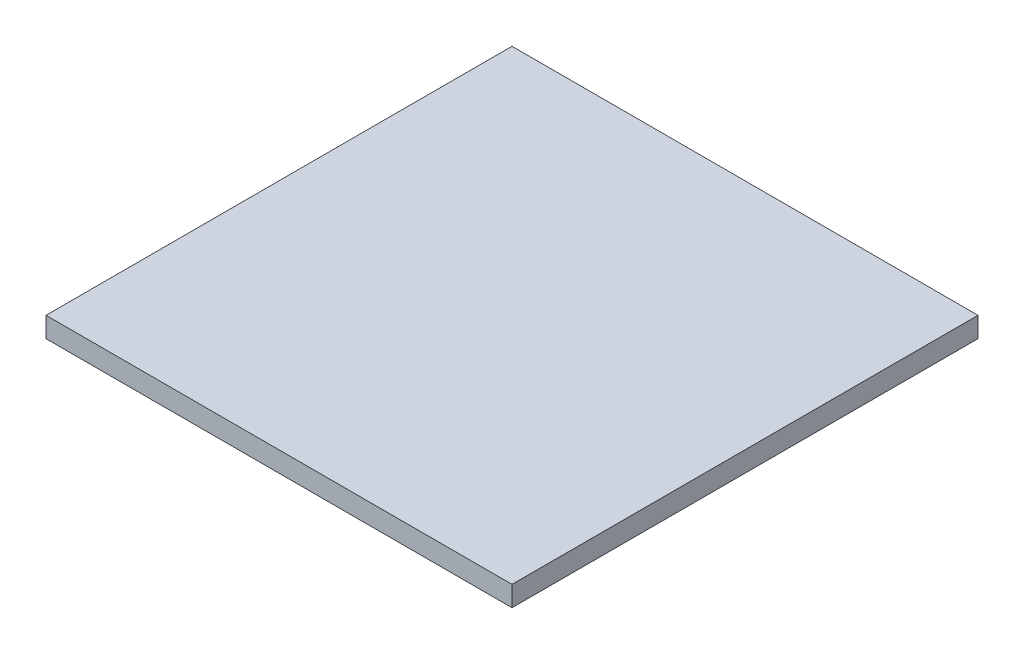
ISO-10303-21;
HEADER;
FILE_DESCRIPTION(('STEP AP214'),'2;1');
FILE_NAME('part.step','',(''),(''),'','','');
FILE_SCHEMA(('AUTOMOTIVE_DESIGN { 1 0 10303 214 1 1 1 1 }'));
ENDSEC;
DATA;
#1=APPLICATION_CONTEXT('core data for automotive mechanical design processes');
#2=APPLICATION_PROTOCOL_DEFINITION('international standard','automotive_design',2000,#1);
#3=PRODUCT_CONTEXT('',#1,'mechanical');
#4=PRODUCT('Part','Part','',(#3));
#5=PRODUCT_RELATED_PRODUCT_CATEGORY('part','',(#4));
#6=PRODUCT_DEFINITION_FORMATION('','',#4);
#7=PRODUCT_DEFINITION_CONTEXT('part definition',#1,'design');
#8=PRODUCT_DEFINITION('design','',#6,#7);
#9=PRODUCT_DEFINITION_SHAPE('','',#8);
#10=(LENGTH_UNIT() NAMED_UNIT(*) SI_UNIT(.MILLI.,.METRE.));
#11=(NAMED_UNIT(*) PLANE_ANGLE_UNIT() SI_UNIT($,.RADIAN.));
#12=(NAMED_UNIT(*) SI_UNIT($,.STERADIAN.) SOLID_ANGLE_UNIT());
#13=UNCERTAINTY_MEASURE_WITH_UNIT(LENGTH_MEASURE(1.E-05),#10,'distance_accuracy_value','');
#14=(GEOMETRIC_REPRESENTATION_CONTEXT(3) GLOBAL_UNCERTAINTY_ASSIGNED_CONTEXT((#13)) GLOBAL_UNIT_ASSIGNED_CONTEXT((#10,
#11,#12)) REPRESENTATION_CONTEXT('',''));
#15=CARTESIAN_POINT('',(0.,0.,0.));
#16=DIRECTION('',(0.,0.,1.));
#17=DIRECTION('',(1.,0.,0.));
#18=AXIS2_PLACEMENT_3D('',#15,#16,#17);
#19=CARTESIAN_POINT('',(146.05,12.7,-146.05));
#20=DIRECTION('',(-1.,0.,0.));
#21=DIRECTION('',(0.,0.,1.));
#22=AXIS2_PLACEMENT_3D('',#19,#20,#21);
#23=PLANE('',#22);
#24=DIRECTION('',(0.,0.,-1.));
#25=VECTOR('',#24,1.);
#26=CARTESIAN_POINT('',(146.05,0.,-146.05));
#27=LINE('',#26,#25);
#28=CARTESIAN_POINT('',(146.05,0.,146.05));
#29=VERTEX_POINT('',#28);
#30=CARTESIAN_POINT('',(146.05,0.,-146.05));
#31=VERTEX_POINT('',#30);
#32=EDGE_CURVE('E96',#29,#31,#27,.T.);
#33=ORIENTED_EDGE('',*,*,#32,.T.);
#34=DIRECTION('',(0.,-1.,0.));
#35=VECTOR('',#34,1.);
#36=CARTESIAN_POINT('',(146.05,12.7,-146.05));
#37=LINE('',#36,#35);
#38=CARTESIAN_POINT('',(146.05,12.7,-146.05));
#39=VERTEX_POINT('',#38);
#40=EDGE_CURVE('E11',#39,#31,#37,.T.);
#41=ORIENTED_EDGE('',*,*,#40,.F.);
#42=DIRECTION('',(0.,0.,-1.));
#43=VECTOR('',#42,1.);
#44=CARTESIAN_POINT('',(146.05,12.7,-146.05));
#45=LINE('',#44,#43);
#46=CARTESIAN_POINT('',(146.05,12.7,146.05));
#47=VERTEX_POINT('',#46);
#48=EDGE_CURVE('E84',#47,#39,#45,.T.);
#49=ORIENTED_EDGE('',*,*,#48,.F.);
#50=DIRECTION('',(0.,-1.,0.));
#51=VECTOR('',#50,1.);
#52=CARTESIAN_POINT('',(146.05,12.7,146.05));
#53=LINE('',#52,#51);
#54=EDGE_CURVE('E92',#47,#29,#53,.T.);
#55=ORIENTED_EDGE('',*,*,#54,.T.);
#56=EDGE_LOOP('',(#33,#41,#49,#55));
#57=FACE_BOUND('',#56,.T.);
#58=ADVANCED_FACE('F33',(#57),#23,.F.);
#59=CARTESIAN_POINT('',(-146.05,12.7,-146.05));
#60=DIRECTION('',(0.,0.,1.));
#61=DIRECTION('',(1.,0.,0.));
#62=AXIS2_PLACEMENT_3D('',#59,#60,#61);
#63=PLANE('',#62);
#64=DIRECTION('',(-1.,0.,0.));
#65=VECTOR('',#64,1.);
#66=CARTESIAN_POINT('',(-146.05,0.,-146.05));
#67=LINE('',#66,#65);
#68=CARTESIAN_POINT('',(-146.05,0.,-146.05));
#69=VERTEX_POINT('',#68);
#70=EDGE_CURVE('E88',#31,#69,#67,.T.);
#71=ORIENTED_EDGE('',*,*,#70,.T.);
#72=DIRECTION('',(0.,-1.,0.));
#73=VECTOR('',#72,1.);
#74=CARTESIAN_POINT('',(-146.05,12.7,-146.05));
#75=LINE('',#74,#73);
#76=CARTESIAN_POINT('',(-146.05,12.7,-146.05));
#77=VERTEX_POINT('',#76);
#78=EDGE_CURVE('E41',#77,#69,#75,.T.);
#79=ORIENTED_EDGE('',*,*,#78,.F.);
#80=DIRECTION('',(-1.,0.,0.));
#81=VECTOR('',#80,1.);
#82=CARTESIAN_POINT('',(-146.05,12.7,-146.05));
#83=LINE('',#82,#81);
#84=EDGE_CURVE('E79',#39,#77,#83,.T.);
#85=ORIENTED_EDGE('',*,*,#84,.F.);
#86=ORIENTED_EDGE('',*,*,#40,.T.);
#87=EDGE_LOOP('',(#71,#79,#85,#86));
#88=FACE_BOUND('',#87,.T.);
#89=ADVANCED_FACE('F87',(#88),#63,.F.);
#90=CARTESIAN_POINT('',(-146.05,12.7,-146.05));
#91=DIRECTION('',(1.,0.,0.));
#92=DIRECTION('',(0.,0.,-1.));
#93=AXIS2_PLACEMENT_3D('',#90,#91,#92);
#94=PLANE('',#93);
#95=DIRECTION('',(0.,0.,1.));
#96=VECTOR('',#95,1.);
#97=CARTESIAN_POINT('',(-146.05,0.,-146.05));
#98=LINE('',#97,#96);
#99=CARTESIAN_POINT('',(-146.05,0.,146.05));
#100=VERTEX_POINT('',#99);
#101=EDGE_CURVE('E66',#69,#100,#98,.T.);
#102=ORIENTED_EDGE('',*,*,#101,.T.);
#103=DIRECTION('',(0.,-1.,0.));
#104=VECTOR('',#103,1.);
#105=CARTESIAN_POINT('',(-146.05,12.7,146.05));
#106=LINE('',#105,#104);
#107=CARTESIAN_POINT('',(-146.05,12.7,146.05));
#108=VERTEX_POINT('',#107);
#109=EDGE_CURVE('E89',#108,#100,#106,.T.);
#110=ORIENTED_EDGE('',*,*,#109,.F.);
#111=DIRECTION('',(0.,0.,1.));
#112=VECTOR('',#111,1.);
#113=CARTESIAN_POINT('',(-146.05,12.7,-146.05));
#114=LINE('',#113,#112);
#115=EDGE_CURVE('E82',#77,#108,#114,.T.);
#116=ORIENTED_EDGE('',*,*,#115,.F.);
#117=ORIENTED_EDGE('',*,*,#78,.T.);
#118=EDGE_LOOP('',(#102,#110,#116,#117));
#119=FACE_BOUND('',#118,.T.);
#120=ADVANCED_FACE('F90',(#119),#94,.F.);
#121=CARTESIAN_POINT('',(-146.05,12.7,146.05));
#122=DIRECTION('',(0.,0.,-1.));
#123=DIRECTION('',(-1.,0.,0.));
#124=AXIS2_PLACEMENT_3D('',#121,#122,#123);
#125=PLANE('',#124);
#126=DIRECTION('',(1.,0.,0.));
#127=VECTOR('',#126,1.);
#128=CARTESIAN_POINT('',(-146.05,0.,146.05));
#129=LINE('',#128,#127);
#130=EDGE_CURVE('E72',#100,#29,#129,.T.);
#131=ORIENTED_EDGE('',*,*,#130,.T.);
#132=ORIENTED_EDGE('',*,*,#54,.F.);
#133=DIRECTION('',(1.,0.,0.));
#134=VECTOR('',#133,1.);
#135=CARTESIAN_POINT('',(-146.05,12.7,146.05));
#136=LINE('',#135,#134);
#137=EDGE_CURVE('E49',#108,#47,#136,.T.);
#138=ORIENTED_EDGE('',*,*,#137,.F.);
#139=ORIENTED_EDGE('',*,*,#109,.T.);
#140=EDGE_LOOP('',(#131,#132,#138,#139));
#141=FACE_BOUND('',#140,.T.);
#142=ADVANCED_FACE('F103',(#141),#125,.F.);
#143=CARTESIAN_POINT('',(0.,12.7,0.));
#144=DIRECTION('',(0.,1.,0.));
#145=DIRECTION('',(0.,0.,1.));
#146=AXIS2_PLACEMENT_3D('',#143,#144,#145);
#147=PLANE('',#146);
#148=ORIENTED_EDGE('',*,*,#48,.T.);
#149=ORIENTED_EDGE('',*,*,#84,.T.);
#150=ORIENTED_EDGE('',*,*,#115,.T.);
#151=ORIENTED_EDGE('',*,*,#137,.T.);
#152=EDGE_LOOP('',(#148,#149,#150,#151));
#153=FACE_BOUND('',#152,.T.);
#154=ADVANCED_FACE('F80',(#153),#147,.T.);
#155=CARTESIAN_POINT('',(0.,0.,0.));
#156=DIRECTION('',(0.,1.,0.));
#157=DIRECTION('',(0.,0.,1.));
#158=AXIS2_PLACEMENT_3D('',#155,#156,#157);
#159=PLANE('',#158);
#160=ORIENTED_EDGE('',*,*,#32,.F.);
#161=ORIENTED_EDGE('',*,*,#130,.F.);
#162=ORIENTED_EDGE('',*,*,#101,.F.);
#163=ORIENTED_EDGE('',*,*,#70,.F.);
#164=EDGE_LOOP('',(#160,#161,#162,#163));
#165=FACE_BOUND('',#164,.T.);
#166=ADVANCED_FACE('F106',(#165),#159,.F.);
#167=CLOSED_SHELL('',(#58,#89,#120,#142,#154,#166));
#168=MANIFOLD_SOLID_BREP('B2',#167);
#169=ADVANCED_BREP_SHAPE_REPRESENTATION('',(#18,#168),#14);
#170=SHAPE_DEFINITION_REPRESENTATION(#9,#169);
ENDSEC;
END-ISO-10303-21;
